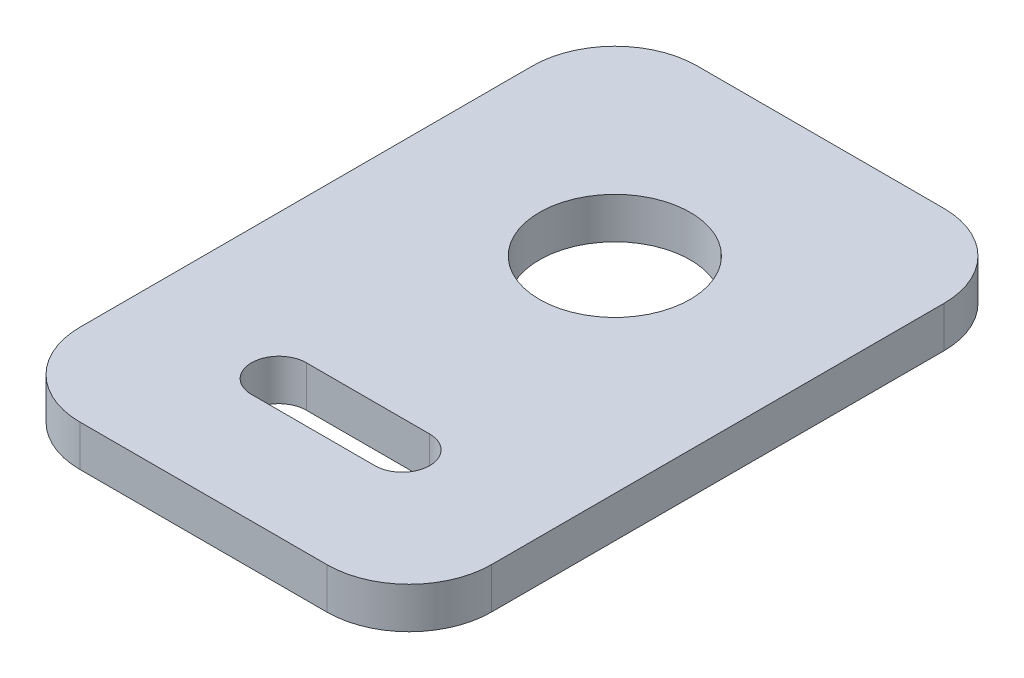
ISO-10303-21;
HEADER;
FILE_DESCRIPTION(('STEP AP214'),'2;1');
FILE_NAME('part.step','',(''),(''),'','','');
FILE_SCHEMA(('AUTOMOTIVE_DESIGN { 1 0 10303 214 1 1 1 1 }'));
ENDSEC;
DATA;
#1=APPLICATION_CONTEXT('core data for automotive mechanical design processes');
#2=APPLICATION_PROTOCOL_DEFINITION('international standard','automotive_design',2000,#1);
#3=PRODUCT_CONTEXT('',#1,'mechanical');
#4=PRODUCT('Part','Part','',(#3));
#5=PRODUCT_RELATED_PRODUCT_CATEGORY('part','',(#4));
#6=PRODUCT_DEFINITION_FORMATION('','',#4);
#7=PRODUCT_DEFINITION_CONTEXT('part definition',#1,'design');
#8=PRODUCT_DEFINITION('design','',#6,#7);
#9=PRODUCT_DEFINITION_SHAPE('','',#8);
#10=(LENGTH_UNIT() NAMED_UNIT(*) SI_UNIT(.MILLI.,.METRE.));
#11=(NAMED_UNIT(*) PLANE_ANGLE_UNIT() SI_UNIT($,.RADIAN.));
#12=(NAMED_UNIT(*) SI_UNIT($,.STERADIAN.) SOLID_ANGLE_UNIT());
#13=UNCERTAINTY_MEASURE_WITH_UNIT(LENGTH_MEASURE(1.E-05),#10,'distance_accuracy_value','');
#14=(GEOMETRIC_REPRESENTATION_CONTEXT(3) GLOBAL_UNCERTAINTY_ASSIGNED_CONTEXT((#13)) GLOBAL_UNIT_ASSIGNED_CONTEXT((#10,
#11,#12)) REPRESENTATION_CONTEXT('',''));
#15=CARTESIAN_POINT('',(0.,0.,0.));
#16=DIRECTION('',(0.,0.,1.));
#17=DIRECTION('',(1.,0.,0.));
#18=AXIS2_PLACEMENT_3D('',#15,#16,#17);
#19=CARTESIAN_POINT('',(0.,1.5,0.));
#20=DIRECTION('',(0.,1.,0.));
#21=DIRECTION('',(0.,0.,1.));
#22=AXIS2_PLACEMENT_3D('',#19,#20,#21);
#23=PLANE('',#22);
#24=DIRECTION('',(1.,0.,0.));
#25=VECTOR('',#24,1.);
#26=CARTESIAN_POINT('',(-2.25,1.5,11.));
#27=LINE('',#26,#25);
#28=CARTESIAN_POINT('',(2.25,1.5,11.));
#29=VERTEX_POINT('',#28);
#30=CARTESIAN_POINT('',(-2.25,1.5,11.));
#31=VERTEX_POINT('',#30);
#32=EDGE_CURVE('E159',#29,#31,#27,.F.);
#33=ORIENTED_EDGE('',*,*,#32,.T.);
#34=CARTESIAN_POINT('',(-2.25,1.5,10.));
#35=DIRECTION('',(0.,1.,0.));
#36=DIRECTION('',(0.,0.,1.));
#37=AXIS2_PLACEMENT_3D('',#34,#35,#36);
#38=CIRCLE('',#37,1.);
#39=CARTESIAN_POINT('',(-2.25,1.5,9.));
#40=VERTEX_POINT('',#39);
#41=EDGE_CURVE('E214',#31,#40,#38,.F.);
#42=ORIENTED_EDGE('',*,*,#41,.T.);
#43=DIRECTION('',(-1.,0.,0.));
#44=VECTOR('',#43,1.);
#45=CARTESIAN_POINT('',(2.25,1.5,9.));
#46=LINE('',#45,#44);
#47=CARTESIAN_POINT('',(2.25,1.5,9.));
#48=VERTEX_POINT('',#47);
#49=EDGE_CURVE('E164',#40,#48,#46,.F.);
#50=ORIENTED_EDGE('',*,*,#49,.T.);
#51=CARTESIAN_POINT('',(2.25,1.5,10.));
#52=DIRECTION('',(0.,1.,0.));
#53=DIRECTION('',(0.,0.,1.));
#54=AXIS2_PLACEMENT_3D('',#51,#52,#53);
#55=CIRCLE('',#54,1.);
#56=EDGE_CURVE('E211',#48,#29,#55,.F.);
#57=ORIENTED_EDGE('',*,*,#56,.T.);
#58=EDGE_LOOP('',(#33,#42,#50,#57));
#59=FACE_BOUND('',#58,.T.);
#60=CARTESIAN_POINT('',(0.,1.5,0.));
#61=DIRECTION('',(0.,1.,0.));
#62=DIRECTION('',(0.,0.,1.));
#63=AXIS2_PLACEMENT_3D('',#60,#61,#62);
#64=CIRCLE('',#63,2.75);
#65=CARTESIAN_POINT('',(0.,1.5,2.75));
#66=VERTEX_POINT('',#65);
#67=EDGE_CURVE('E217',#66,#66,#64,.F.);
#68=ORIENTED_EDGE('',*,*,#67,.T.);
#69=EDGE_LOOP('',(#68));
#70=FACE_BOUND('',#69,.T.);
#71=DIRECTION('',(1.,0.,0.));
#72=VECTOR('',#71,1.);
#73=CARTESIAN_POINT('',(-7.5,1.5,15.));
#74=LINE('',#73,#72);
#75=CARTESIAN_POINT('',(4.5,1.5,15.));
#76=VERTEX_POINT('',#75);
#77=CARTESIAN_POINT('',(-4.5,1.5,15.));
#78=VERTEX_POINT('',#77);
#79=EDGE_CURVE('E142',#76,#78,#74,.F.);
#80=ORIENTED_EDGE('',*,*,#79,.F.);
#81=CARTESIAN_POINT('',(4.5,1.5,12.));
#82=DIRECTION('',(0.,-1.,0.));
#83=DIRECTION('',(0.,0.,-1.));
#84=AXIS2_PLACEMENT_3D('',#81,#82,#83);
#85=CIRCLE('',#84,3.);
#86=CARTESIAN_POINT('',(7.5,1.5,12.));
#87=VERTEX_POINT('',#86);
#88=EDGE_CURVE('E19',#87,#76,#85,.T.);
#89=ORIENTED_EDGE('',*,*,#88,.F.);
#90=DIRECTION('',(0.,0.,-1.));
#91=VECTOR('',#90,1.);
#92=CARTESIAN_POINT('',(7.5,1.5,15.));
#93=LINE('',#92,#91);
#94=CARTESIAN_POINT('',(7.5,1.5,-4.5));
#95=VERTEX_POINT('',#94);
#96=EDGE_CURVE('E127',#95,#87,#93,.F.);
#97=ORIENTED_EDGE('',*,*,#96,.F.);
#98=CARTESIAN_POINT('',(4.5,1.5,-4.5));
#99=DIRECTION('',(0.,-1.,0.));
#100=DIRECTION('',(0.,0.,-1.));
#101=AXIS2_PLACEMENT_3D('',#98,#99,#100);
#102=CIRCLE('',#101,3.);
#103=CARTESIAN_POINT('',(4.5,1.5,-7.5));
#104=VERTEX_POINT('',#103);
#105=EDGE_CURVE('E151',#104,#95,#102,.T.);
#106=ORIENTED_EDGE('',*,*,#105,.F.);
#107=DIRECTION('',(-1.,0.,0.));
#108=VECTOR('',#107,1.);
#109=CARTESIAN_POINT('',(7.5,1.5,-7.5));
#110=LINE('',#109,#108);
#111=CARTESIAN_POINT('',(-4.5,1.5,-7.5));
#112=VERTEX_POINT('',#111);
#113=EDGE_CURVE('E178',#112,#104,#110,.F.);
#114=ORIENTED_EDGE('',*,*,#113,.F.);
#115=CARTESIAN_POINT('',(-4.5,1.5,-4.5));
#116=DIRECTION('',(0.,-1.,0.));
#117=DIRECTION('',(0.,0.,-1.));
#118=AXIS2_PLACEMENT_3D('',#115,#116,#117);
#119=CIRCLE('',#118,3.);
#120=CARTESIAN_POINT('',(-7.5,1.5,-4.5));
#121=VERTEX_POINT('',#120);
#122=EDGE_CURVE('E225',#121,#112,#119,.T.);
#123=ORIENTED_EDGE('',*,*,#122,.F.);
#124=DIRECTION('',(0.,0.,1.));
#125=VECTOR('',#124,1.);
#126=CARTESIAN_POINT('',(-7.5,1.5,-7.5));
#127=LINE('',#126,#125);
#128=CARTESIAN_POINT('',(-7.5,1.5,12.));
#129=VERTEX_POINT('',#128);
#130=EDGE_CURVE('E173',#129,#121,#127,.F.);
#131=ORIENTED_EDGE('',*,*,#130,.F.);
#132=CARTESIAN_POINT('',(-4.5,1.5,12.));
#133=DIRECTION('',(0.,-1.,0.));
#134=DIRECTION('',(0.,0.,-1.));
#135=AXIS2_PLACEMENT_3D('',#132,#133,#134);
#136=CIRCLE('',#135,3.);
#137=EDGE_CURVE('E222',#78,#129,#136,.T.);
#138=ORIENTED_EDGE('',*,*,#137,.F.);
#139=EDGE_LOOP('',(#80,#89,#97,#106,#114,#123,#131,#138));
#140=FACE_BOUND('',#139,.T.);
#141=ADVANCED_FACE('F16',(#59,#70,#140),#23,.T.);
#142=CARTESIAN_POINT('',(4.5,5.259,12.));
#143=DIRECTION('',(0.,-1.,0.));
#144=DIRECTION('',(0.,0.,-1.));
#145=AXIS2_PLACEMENT_3D('',#142,#143,#144);
#146=CYLINDRICAL_SURFACE('',#145,3.);
#147=DIRECTION('',(0.,1.,0.));
#148=VECTOR('',#147,1.);
#149=CARTESIAN_POINT('',(4.5,0.,15.));
#150=LINE('',#149,#148);
#151=CARTESIAN_POINT('',(4.5,0.,15.));
#152=VERTEX_POINT('',#151);
#153=EDGE_CURVE('E221',#152,#76,#150,.T.);
#154=ORIENTED_EDGE('',*,*,#153,.F.);
#155=CARTESIAN_POINT('',(4.5,0.,12.));
#156=DIRECTION('',(0.,-1.,0.));
#157=DIRECTION('',(0.,0.,-1.));
#158=AXIS2_PLACEMENT_3D('',#155,#156,#157);
#159=CIRCLE('',#158,3.);
#160=CARTESIAN_POINT('',(7.5,0.,12.));
#161=VERTEX_POINT('',#160);
#162=EDGE_CURVE('E149',#152,#161,#159,.F.);
#163=ORIENTED_EDGE('',*,*,#162,.T.);
#164=DIRECTION('',(0.,1.,0.));
#165=VECTOR('',#164,1.);
#166=CARTESIAN_POINT('',(7.5,0.,12.));
#167=LINE('',#166,#165);
#168=EDGE_CURVE('E132',#87,#161,#167,.F.);
#169=ORIENTED_EDGE('',*,*,#168,.F.);
#170=ORIENTED_EDGE('',*,*,#88,.T.);
#171=EDGE_LOOP('',(#154,#163,#169,#170));
#172=FACE_BOUND('',#171,.T.);
#173=ADVANCED_FACE('F148',(#172),#146,.T.);
#174=CARTESIAN_POINT('',(7.5,0.,15.));
#175=DIRECTION('',(1.,0.,0.));
#176=DIRECTION('',(0.,0.,-1.));
#177=AXIS2_PLACEMENT_3D('',#174,#175,#176);
#178=PLANE('',#177);
#179=ORIENTED_EDGE('',*,*,#96,.T.);
#180=ORIENTED_EDGE('',*,*,#168,.T.);
#181=DIRECTION('',(0.,0.,1.));
#182=VECTOR('',#181,1.);
#183=CARTESIAN_POINT('',(7.5,0.,0.));
#184=LINE('',#183,#182);
#185=CARTESIAN_POINT('',(7.5,0.,-4.5));
#186=VERTEX_POINT('',#185);
#187=EDGE_CURVE('E208',#161,#186,#184,.F.);
#188=ORIENTED_EDGE('',*,*,#187,.T.);
#189=DIRECTION('',(0.,-1.,0.));
#190=VECTOR('',#189,1.);
#191=CARTESIAN_POINT('',(7.5,5.259,-4.5));
#192=LINE('',#191,#190);
#193=EDGE_CURVE('E134',#95,#186,#192,.T.);
#194=ORIENTED_EDGE('',*,*,#193,.F.);
#195=EDGE_LOOP('',(#179,#180,#188,#194));
#196=FACE_BOUND('',#195,.T.);
#197=ADVANCED_FACE('F129',(#196),#178,.T.);
#198=CARTESIAN_POINT('',(4.5,5.259,-4.5));
#199=DIRECTION('',(0.,-1.,0.));
#200=DIRECTION('',(0.,0.,-1.));
#201=AXIS2_PLACEMENT_3D('',#198,#199,#200);
#202=CYLINDRICAL_SURFACE('',#201,3.);
#203=ORIENTED_EDGE('',*,*,#193,.T.);
#204=CARTESIAN_POINT('',(4.5,0.,-4.5));
#205=DIRECTION('',(0.,-1.,0.));
#206=DIRECTION('',(0.,0.,-1.));
#207=AXIS2_PLACEMENT_3D('',#204,#205,#206);
#208=CIRCLE('',#207,3.);
#209=CARTESIAN_POINT('',(4.5,0.,-7.5));
#210=VERTEX_POINT('',#209);
#211=EDGE_CURVE('E204',#186,#210,#208,.F.);
#212=ORIENTED_EDGE('',*,*,#211,.T.);
#213=DIRECTION('',(0.,1.,0.));
#214=VECTOR('',#213,1.);
#215=CARTESIAN_POINT('',(4.5,0.,-7.5));
#216=LINE('',#215,#214);
#217=EDGE_CURVE('E180',#104,#210,#216,.F.);
#218=ORIENTED_EDGE('',*,*,#217,.F.);
#219=ORIENTED_EDGE('',*,*,#105,.T.);
#220=EDGE_LOOP('',(#203,#212,#218,#219));
#221=FACE_BOUND('',#220,.T.);
#222=ADVANCED_FACE('F314',(#221),#202,.T.);
#223=CARTESIAN_POINT('',(7.5,0.,-7.5));
#224=DIRECTION('',(0.,0.,-1.));
#225=DIRECTION('',(-1.,0.,0.));
#226=AXIS2_PLACEMENT_3D('',#223,#224,#225);
#227=PLANE('',#226);
#228=ORIENTED_EDGE('',*,*,#113,.T.);
#229=ORIENTED_EDGE('',*,*,#217,.T.);
#230=DIRECTION('',(1.,0.,0.));
#231=VECTOR('',#230,1.);
#232=CARTESIAN_POINT('',(0.,0.,-7.5));
#233=LINE('',#232,#231);
#234=CARTESIAN_POINT('',(-4.5,0.,-7.5));
#235=VERTEX_POINT('',#234);
#236=EDGE_CURVE('E203',#210,#235,#233,.F.);
#237=ORIENTED_EDGE('',*,*,#236,.T.);
#238=DIRECTION('',(0.,-1.,0.));
#239=VECTOR('',#238,1.);
#240=CARTESIAN_POINT('',(-4.5,5.259,-7.5));
#241=LINE('',#240,#239);
#242=EDGE_CURVE('E177',#112,#235,#241,.T.);
#243=ORIENTED_EDGE('',*,*,#242,.F.);
#244=EDGE_LOOP('',(#228,#229,#237,#243));
#245=FACE_BOUND('',#244,.T.);
#246=ADVANCED_FACE('F312',(#245),#227,.T.);
#247=CARTESIAN_POINT('',(-4.5,5.259,-4.5));
#248=DIRECTION('',(0.,-1.,0.));
#249=DIRECTION('',(0.,0.,-1.));
#250=AXIS2_PLACEMENT_3D('',#247,#248,#249);
#251=CYLINDRICAL_SURFACE('',#250,3.);
#252=ORIENTED_EDGE('',*,*,#242,.T.);
#253=CARTESIAN_POINT('',(-4.5,0.,-4.5));
#254=DIRECTION('',(0.,-1.,0.));
#255=DIRECTION('',(0.,0.,-1.));
#256=AXIS2_PLACEMENT_3D('',#253,#254,#255);
#257=CIRCLE('',#256,3.);
#258=CARTESIAN_POINT('',(-7.5,0.,-4.5));
#259=VERTEX_POINT('',#258);
#260=EDGE_CURVE('E199',#235,#259,#257,.F.);
#261=ORIENTED_EDGE('',*,*,#260,.T.);
#262=DIRECTION('',(0.,1.,0.));
#263=VECTOR('',#262,1.);
#264=CARTESIAN_POINT('',(-7.5,0.,-4.5));
#265=LINE('',#264,#263);
#266=EDGE_CURVE('E176',#121,#259,#265,.F.);
#267=ORIENTED_EDGE('',*,*,#266,.F.);
#268=ORIENTED_EDGE('',*,*,#122,.T.);
#269=EDGE_LOOP('',(#252,#261,#267,#268));
#270=FACE_BOUND('',#269,.T.);
#271=ADVANCED_FACE('F309',(#270),#251,.T.);
#272=CARTESIAN_POINT('',(-7.5,0.,-7.5));
#273=DIRECTION('',(-1.,0.,0.));
#274=DIRECTION('',(0.,0.,1.));
#275=AXIS2_PLACEMENT_3D('',#272,#273,#274);
#276=PLANE('',#275);
#277=ORIENTED_EDGE('',*,*,#130,.T.);
#278=ORIENTED_EDGE('',*,*,#266,.T.);
#279=DIRECTION('',(0.,0.,1.));
#280=VECTOR('',#279,1.);
#281=CARTESIAN_POINT('',(-7.5,0.,0.));
#282=LINE('',#281,#280);
#283=CARTESIAN_POINT('',(-7.5,0.,12.));
#284=VERTEX_POINT('',#283);
#285=EDGE_CURVE('E198',#259,#284,#282,.T.);
#286=ORIENTED_EDGE('',*,*,#285,.T.);
#287=DIRECTION('',(0.,-1.,0.));
#288=VECTOR('',#287,1.);
#289=CARTESIAN_POINT('',(-7.5,5.259,12.));
#290=LINE('',#289,#288);
#291=EDGE_CURVE('E172',#129,#284,#290,.T.);
#292=ORIENTED_EDGE('',*,*,#291,.F.);
#293=EDGE_LOOP('',(#277,#278,#286,#292));
#294=FACE_BOUND('',#293,.T.);
#295=ADVANCED_FACE('F307',(#294),#276,.T.);
#296=CARTESIAN_POINT('',(-4.5,5.259,12.));
#297=DIRECTION('',(0.,-1.,0.));
#298=DIRECTION('',(0.,0.,-1.));
#299=AXIS2_PLACEMENT_3D('',#296,#297,#298);
#300=CYLINDRICAL_SURFACE('',#299,3.);
#301=ORIENTED_EDGE('',*,*,#291,.T.);
#302=CARTESIAN_POINT('',(-4.5,0.,12.));
#303=DIRECTION('',(0.,-1.,0.));
#304=DIRECTION('',(0.,0.,-1.));
#305=AXIS2_PLACEMENT_3D('',#302,#303,#304);
#306=CIRCLE('',#305,3.);
#307=CARTESIAN_POINT('',(-4.5,0.,15.));
#308=VERTEX_POINT('',#307);
#309=EDGE_CURVE('E194',#284,#308,#306,.F.);
#310=ORIENTED_EDGE('',*,*,#309,.T.);
#311=DIRECTION('',(0.,1.,0.));
#312=VECTOR('',#311,1.);
#313=CARTESIAN_POINT('',(-4.5,0.,15.));
#314=LINE('',#313,#312);
#315=EDGE_CURVE('E171',#78,#308,#314,.F.);
#316=ORIENTED_EDGE('',*,*,#315,.F.);
#317=ORIENTED_EDGE('',*,*,#137,.T.);
#318=EDGE_LOOP('',(#301,#310,#316,#317));
#319=FACE_BOUND('',#318,.T.);
#320=ADVANCED_FACE('F316',(#319),#300,.T.);
#321=CARTESIAN_POINT('',(-7.5,0.,15.));
#322=DIRECTION('',(0.,0.,1.));
#323=DIRECTION('',(1.,0.,0.));
#324=AXIS2_PLACEMENT_3D('',#321,#322,#323);
#325=PLANE('',#324);
#326=DIRECTION('',(1.,0.,0.));
#327=VECTOR('',#326,1.);
#328=CARTESIAN_POINT('',(0.,0.,15.));
#329=LINE('',#328,#327);
#330=EDGE_CURVE('E193',#308,#152,#329,.T.);
#331=ORIENTED_EDGE('',*,*,#330,.T.);
#332=ORIENTED_EDGE('',*,*,#153,.T.);
#333=ORIENTED_EDGE('',*,*,#79,.T.);
#334=ORIENTED_EDGE('',*,*,#315,.T.);
#335=EDGE_LOOP('',(#331,#332,#333,#334));
#336=FACE_BOUND('',#335,.T.);
#337=ADVANCED_FACE('F293',(#336),#325,.T.);
#338=CARTESIAN_POINT('',(0.,0.,0.));
#339=DIRECTION('',(0.,1.,0.));
#340=DIRECTION('',(0.,0.,1.));
#341=AXIS2_PLACEMENT_3D('',#338,#339,#340);
#342=CYLINDRICAL_SURFACE('',#341,2.75);
#343=ORIENTED_EDGE('',*,*,#67,.F.);
#344=EDGE_LOOP('',(#343));
#345=FACE_BOUND('',#344,.T.);
#346=CARTESIAN_POINT('',(0.,0.,0.));
#347=DIRECTION('',(0.,1.,0.));
#348=DIRECTION('',(0.,0.,1.));
#349=AXIS2_PLACEMENT_3D('',#346,#347,#348);
#350=CIRCLE('',#349,2.75);
#351=CARTESIAN_POINT('',(0.,0.,2.75));
#352=VERTEX_POINT('',#351);
#353=EDGE_CURVE('E189',#352,#352,#350,.F.);
#354=ORIENTED_EDGE('',*,*,#353,.T.);
#355=EDGE_LOOP('',(#354));
#356=FACE_BOUND('',#355,.T.);
#357=ADVANCED_FACE('F290',(#345,#356),#342,.F.);
#358=CARTESIAN_POINT('',(-2.25,1.5,10.));
#359=DIRECTION('',(0.,1.,0.));
#360=DIRECTION('',(0.,0.,1.));
#361=AXIS2_PLACEMENT_3D('',#358,#359,#360);
#362=CYLINDRICAL_SURFACE('',#361,1.);
#363=ORIENTED_EDGE('',*,*,#41,.F.);
#364=DIRECTION('',(0.,1.,0.));
#365=VECTOR('',#364,1.);
#366=CARTESIAN_POINT('',(-2.25,1.5,11.));
#367=LINE('',#366,#365);
#368=CARTESIAN_POINT('',(-2.25,0.,11.));
#369=VERTEX_POINT('',#368);
#370=EDGE_CURVE('E163',#31,#369,#367,.F.);
#371=ORIENTED_EDGE('',*,*,#370,.T.);
#372=CARTESIAN_POINT('',(-2.25,0.,10.));
#373=DIRECTION('',(0.,1.,0.));
#374=DIRECTION('',(0.,0.,1.));
#375=AXIS2_PLACEMENT_3D('',#372,#373,#374);
#376=CIRCLE('',#375,1.);
#377=CARTESIAN_POINT('',(-2.25,0.,9.));
#378=VERTEX_POINT('',#377);
#379=EDGE_CURVE('E185',#369,#378,#376,.F.);
#380=ORIENTED_EDGE('',*,*,#379,.T.);
#381=DIRECTION('',(0.,1.,0.));
#382=VECTOR('',#381,1.);
#383=CARTESIAN_POINT('',(-2.25,1.5,9.));
#384=LINE('',#383,#382);
#385=EDGE_CURVE('E168',#378,#40,#384,.T.);
#386=ORIENTED_EDGE('',*,*,#385,.T.);
#387=EDGE_LOOP('',(#363,#371,#380,#386));
#388=FACE_BOUND('',#387,.T.);
#389=ADVANCED_FACE('F279',(#388),#362,.F.);
#390=CARTESIAN_POINT('',(2.25,1.5,9.));
#391=DIRECTION('',(0.,0.,-1.));
#392=DIRECTION('',(-1.,0.,0.));
#393=AXIS2_PLACEMENT_3D('',#390,#391,#392);
#394=PLANE('',#393);
#395=ORIENTED_EDGE('',*,*,#49,.F.);
#396=ORIENTED_EDGE('',*,*,#385,.F.);
#397=DIRECTION('',(1.,0.,0.));
#398=VECTOR('',#397,1.);
#399=CARTESIAN_POINT('',(0.,0.,9.));
#400=LINE('',#399,#398);
#401=CARTESIAN_POINT('',(2.25,0.,9.));
#402=VERTEX_POINT('',#401);
#403=EDGE_CURVE('E184',#378,#402,#400,.T.);
#404=ORIENTED_EDGE('',*,*,#403,.T.);
#405=DIRECTION('',(0.,1.,0.));
#406=VECTOR('',#405,1.);
#407=CARTESIAN_POINT('',(2.25,1.5,9.));
#408=LINE('',#407,#406);
#409=EDGE_CURVE('E167',#402,#48,#408,.T.);
#410=ORIENTED_EDGE('',*,*,#409,.T.);
#411=EDGE_LOOP('',(#395,#396,#404,#410));
#412=FACE_BOUND('',#411,.T.);
#413=ADVANCED_FACE('F273',(#412),#394,.F.);
#414=CARTESIAN_POINT('',(2.25,1.5,10.));
#415=DIRECTION('',(0.,1.,0.));
#416=DIRECTION('',(0.,0.,1.));
#417=AXIS2_PLACEMENT_3D('',#414,#415,#416);
#418=CYLINDRICAL_SURFACE('',#417,1.);
#419=ORIENTED_EDGE('',*,*,#56,.F.);
#420=ORIENTED_EDGE('',*,*,#409,.F.);
#421=CARTESIAN_POINT('',(2.25,0.,10.));
#422=DIRECTION('',(0.,1.,0.));
#423=DIRECTION('',(0.,0.,1.));
#424=AXIS2_PLACEMENT_3D('',#421,#422,#423);
#425=CIRCLE('',#424,1.);
#426=CARTESIAN_POINT('',(2.25,0.,11.));
#427=VERTEX_POINT('',#426);
#428=EDGE_CURVE('E26',#402,#427,#425,.F.);
#429=ORIENTED_EDGE('',*,*,#428,.T.);
#430=DIRECTION('',(0.,1.,0.));
#431=VECTOR('',#430,1.);
#432=CARTESIAN_POINT('',(2.25,1.5,11.));
#433=LINE('',#432,#431);
#434=EDGE_CURVE('E38',#427,#29,#433,.T.);
#435=ORIENTED_EDGE('',*,*,#434,.T.);
#436=EDGE_LOOP('',(#419,#420,#429,#435));
#437=FACE_BOUND('',#436,.T.);
#438=ADVANCED_FACE('F284',(#437),#418,.F.);
#439=CARTESIAN_POINT('',(-2.25,1.5,11.));
#440=DIRECTION('',(0.,0.,1.));
#441=DIRECTION('',(1.,0.,0.));
#442=AXIS2_PLACEMENT_3D('',#439,#440,#441);
#443=PLANE('',#442);
#444=ORIENTED_EDGE('',*,*,#32,.F.);
#445=ORIENTED_EDGE('',*,*,#434,.F.);
#446=DIRECTION('',(1.,0.,0.));
#447=VECTOR('',#446,1.);
#448=CARTESIAN_POINT('',(0.,0.,11.));
#449=LINE('',#448,#447);
#450=EDGE_CURVE('E11',#427,#369,#449,.F.);
#451=ORIENTED_EDGE('',*,*,#450,.T.);
#452=ORIENTED_EDGE('',*,*,#370,.F.);
#453=EDGE_LOOP('',(#444,#445,#451,#452));
#454=FACE_BOUND('',#453,.T.);
#455=ADVANCED_FACE('F281',(#454),#443,.F.);
#456=CARTESIAN_POINT('',(0.,0.,0.));
#457=DIRECTION('',(0.,1.,0.));
#458=DIRECTION('',(0.,0.,1.));
#459=AXIS2_PLACEMENT_3D('',#456,#457,#458);
#460=PLANE('',#459);
#461=ORIENTED_EDGE('',*,*,#428,.F.);
#462=ORIENTED_EDGE('',*,*,#403,.F.);
#463=ORIENTED_EDGE('',*,*,#379,.F.);
#464=ORIENTED_EDGE('',*,*,#450,.F.);
#465=EDGE_LOOP('',(#461,#462,#463,#464));
#466=FACE_BOUND('',#465,.T.);
#467=ORIENTED_EDGE('',*,*,#353,.F.);
#468=EDGE_LOOP('',(#467));
#469=FACE_BOUND('',#468,.T.);
#470=ORIENTED_EDGE('',*,*,#309,.F.);
#471=ORIENTED_EDGE('',*,*,#285,.F.);
#472=ORIENTED_EDGE('',*,*,#260,.F.);
#473=ORIENTED_EDGE('',*,*,#236,.F.);
#474=ORIENTED_EDGE('',*,*,#211,.F.);
#475=ORIENTED_EDGE('',*,*,#187,.F.);
#476=ORIENTED_EDGE('',*,*,#162,.F.);
#477=ORIENTED_EDGE('',*,*,#330,.F.);
#478=EDGE_LOOP('',(#470,#471,#472,#473,#474,#475,#476,#477));
#479=FACE_BOUND('',#478,.T.);
#480=ADVANCED_FACE('F276',(#466,#469,#479),#460,.F.);
#481=CLOSED_SHELL('',(#141,#173,#197,#222,#246,#271,#295,#320,#337,#357,#389,#413,#438,#455,#480));
#482=MANIFOLD_SOLID_BREP('B1',#481);
#483=ADVANCED_BREP_SHAPE_REPRESENTATION('',(#18,#482),#14);
#484=SHAPE_DEFINITION_REPRESENTATION(#9,#483);
ENDSEC;
END-ISO-10303-21;
